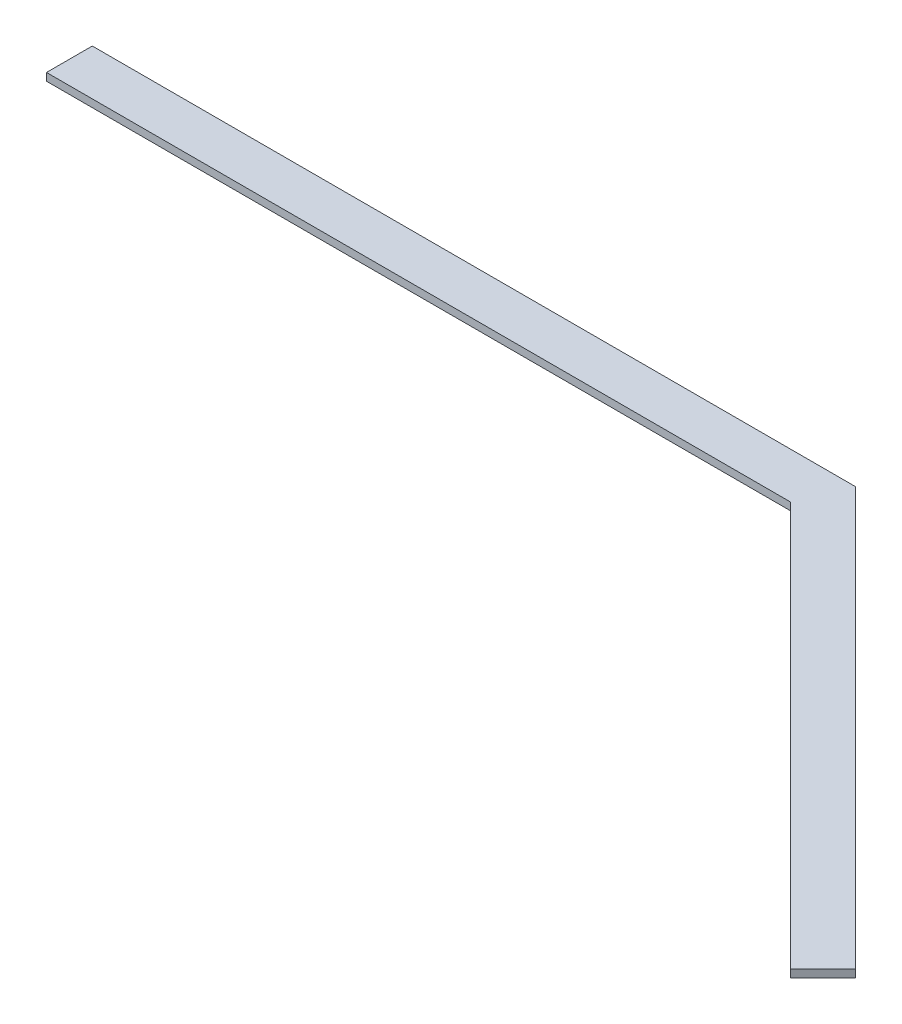
ISO-10303-21;
HEADER;
FILE_DESCRIPTION(('STEP AP214'),'2;1');
FILE_NAME('part.step','',(''),(''),'','','');
FILE_SCHEMA(('AUTOMOTIVE_DESIGN { 1 0 10303 214 1 1 1 1 }'));
ENDSEC;
DATA;
#1=APPLICATION_CONTEXT('core data for automotive mechanical design processes');
#2=APPLICATION_PROTOCOL_DEFINITION('international standard','automotive_design',2000,#1);
#3=PRODUCT_CONTEXT('',#1,'mechanical');
#4=PRODUCT('Part','Part','',(#3));
#5=PRODUCT_RELATED_PRODUCT_CATEGORY('part','',(#4));
#6=PRODUCT_DEFINITION_FORMATION('','',#4);
#7=PRODUCT_DEFINITION_CONTEXT('part definition',#1,'design');
#8=PRODUCT_DEFINITION('design','',#6,#7);
#9=PRODUCT_DEFINITION_SHAPE('','',#8);
#10=(LENGTH_UNIT() NAMED_UNIT(*) SI_UNIT(.MILLI.,.METRE.));
#11=(NAMED_UNIT(*) PLANE_ANGLE_UNIT() SI_UNIT($,.RADIAN.));
#12=(NAMED_UNIT(*) SI_UNIT($,.STERADIAN.) SOLID_ANGLE_UNIT());
#13=UNCERTAINTY_MEASURE_WITH_UNIT(LENGTH_MEASURE(1.E-05),#10,'distance_accuracy_value','');
#14=(GEOMETRIC_REPRESENTATION_CONTEXT(3) GLOBAL_UNCERTAINTY_ASSIGNED_CONTEXT((#13)) GLOBAL_UNIT_ASSIGNED_CONTEXT((#10,
#11,#12)) REPRESENTATION_CONTEXT('',''));
#15=CARTESIAN_POINT('',(0.,0.,0.));
#16=DIRECTION('',(0.,0.,1.));
#17=DIRECTION('',(1.,0.,0.));
#18=AXIS2_PLACEMENT_3D('',#15,#16,#17);
#19=CARTESIAN_POINT('',(-273.786796564403,5.,-273.786796564404));
#20=DIRECTION('',(-0.707106781186549,0.,0.707106781186546));
#21=DIRECTION('',(0.707106781186546,0.,0.707106781186549));
#22=AXIS2_PLACEMENT_3D('',#19,#20,#21);
#23=PLANE('',#22);
#24=DIRECTION('',(-0.707106781186546,0.,-0.707106781186549));
#25=VECTOR('',#24,1.);
#26=CARTESIAN_POINT('',(-273.786796564403,0.,-273.786796564404));
#27=LINE('',#26,#25);
#28=CARTESIAN_POINT('',(0.,0.,0.));
#29=VERTEX_POINT('',#28);
#30=CARTESIAN_POINT('',(-273.786796564403,0.,-273.786796564404));
#31=VERTEX_POINT('',#30);
#32=EDGE_CURVE('E121',#29,#31,#27,.T.);
#33=ORIENTED_EDGE('',*,*,#32,.T.);
#34=DIRECTION('',(0.,-1.,0.));
#35=VECTOR('',#34,1.);
#36=CARTESIAN_POINT('',(-273.786796564403,5.,-273.786796564404));
#37=LINE('',#36,#35);
#38=CARTESIAN_POINT('',(-273.786796564403,5.,-273.786796564404));
#39=VERTEX_POINT('',#38);
#40=EDGE_CURVE('E11',#39,#31,#37,.T.);
#41=ORIENTED_EDGE('',*,*,#40,.F.);
#42=DIRECTION('',(-0.707106781186546,0.,-0.707106781186549));
#43=VECTOR('',#42,1.);
#44=CARTESIAN_POINT('',(-273.786796564403,5.,-273.786796564404));
#45=LINE('',#44,#43);
#46=CARTESIAN_POINT('',(0.,5.,0.));
#47=VERTEX_POINT('',#46);
#48=EDGE_CURVE('E131',#47,#39,#45,.T.);
#49=ORIENTED_EDGE('',*,*,#48,.F.);
#50=DIRECTION('',(0.,-1.,0.));
#51=VECTOR('',#50,1.);
#52=CARTESIAN_POINT('',(0.,5.,0.));
#53=LINE('',#52,#51);
#54=EDGE_CURVE('E117',#47,#29,#53,.T.);
#55=ORIENTED_EDGE('',*,*,#54,.T.);
#56=EDGE_LOOP('',(#33,#41,#49,#55));
#57=FACE_BOUND('',#56,.T.);
#58=ADVANCED_FACE('F37',(#57),#23,.F.);
#59=CARTESIAN_POINT('',(-273.786796564403,5.,-273.786796564404));
#60=DIRECTION('',(0.,0.,1.));
#61=DIRECTION('',(1.,0.,0.));
#62=AXIS2_PLACEMENT_3D('',#59,#60,#61);
#63=PLANE('',#62);
#64=DIRECTION('',(-1.,0.,0.));
#65=VECTOR('',#64,1.);
#66=CARTESIAN_POINT('',(-273.786796564403,0.,-273.786796564404));
#67=LINE('',#66,#65);
#68=CARTESIAN_POINT('',(-773.786796564403,0.,-273.786796564404));
#69=VERTEX_POINT('',#68);
#70=EDGE_CURVE('E124',#31,#69,#67,.T.);
#71=ORIENTED_EDGE('',*,*,#70,.T.);
#72=DIRECTION('',(0.,-1.,0.));
#73=VECTOR('',#72,1.);
#74=CARTESIAN_POINT('',(-773.786796564403,5.,-273.786796564404));
#75=LINE('',#74,#73);
#76=CARTESIAN_POINT('',(-773.786796564403,5.,-273.786796564404));
#77=VERTEX_POINT('',#76);
#78=EDGE_CURVE('E45',#77,#69,#75,.T.);
#79=ORIENTED_EDGE('',*,*,#78,.F.);
#80=DIRECTION('',(-1.,0.,0.));
#81=VECTOR('',#80,1.);
#82=CARTESIAN_POINT('',(-273.786796564403,5.,-273.786796564404));
#83=LINE('',#82,#81);
#84=EDGE_CURVE('E90',#39,#77,#83,.T.);
#85=ORIENTED_EDGE('',*,*,#84,.F.);
#86=ORIENTED_EDGE('',*,*,#40,.T.);
#87=EDGE_LOOP('',(#71,#79,#85,#86));
#88=FACE_BOUND('',#87,.T.);
#89=ADVANCED_FACE('F155',(#88),#63,.F.);
#90=CARTESIAN_POINT('',(-773.786796564403,5.,-273.786796564404));
#91=DIRECTION('',(1.,0.,0.));
#92=DIRECTION('',(0.,0.,-1.));
#93=AXIS2_PLACEMENT_3D('',#90,#91,#92);
#94=PLANE('',#93);
#95=DIRECTION('',(0.,0.,1.));
#96=VECTOR('',#95,1.);
#97=CARTESIAN_POINT('',(-773.786796564403,0.,-273.786796564404));
#98=LINE('',#97,#96);
#99=CARTESIAN_POINT('',(-773.786796564402,0.,-243.786796564404));
#100=VERTEX_POINT('',#99);
#101=EDGE_CURVE('E126',#69,#100,#98,.T.);
#102=ORIENTED_EDGE('',*,*,#101,.T.);
#103=DIRECTION('',(0.,-1.,0.));
#104=VECTOR('',#103,1.);
#105=CARTESIAN_POINT('',(-773.786796564402,5.,-243.786796564404));
#106=LINE('',#105,#104);
#107=CARTESIAN_POINT('',(-773.786796564402,5.,-243.786796564404));
#108=VERTEX_POINT('',#107);
#109=EDGE_CURVE('E112',#108,#100,#106,.T.);
#110=ORIENTED_EDGE('',*,*,#109,.F.);
#111=DIRECTION('',(0.,0.,1.));
#112=VECTOR('',#111,1.);
#113=CARTESIAN_POINT('',(-773.786796564403,5.,-273.786796564404));
#114=LINE('',#113,#112);
#115=EDGE_CURVE('E103',#77,#108,#114,.T.);
#116=ORIENTED_EDGE('',*,*,#115,.F.);
#117=ORIENTED_EDGE('',*,*,#78,.T.);
#118=EDGE_LOOP('',(#102,#110,#116,#117));
#119=FACE_BOUND('',#118,.T.);
#120=ADVANCED_FACE('F137',(#119),#94,.F.);
#121=CARTESIAN_POINT('',(-773.786796564402,5.,-243.786796564404));
#122=DIRECTION('',(0.,0.,-1.));
#123=DIRECTION('',(-1.,0.,0.));
#124=AXIS2_PLACEMENT_3D('',#121,#122,#123);
#125=PLANE('',#124);
#126=DIRECTION('',(1.,0.,0.));
#127=VECTOR('',#126,1.);
#128=CARTESIAN_POINT('',(-773.786796564402,0.,-243.786796564404));
#129=LINE('',#128,#127);
#130=CARTESIAN_POINT('',(-286.213203435595,0.,-243.786796564404));
#131=VERTEX_POINT('',#130);
#132=EDGE_CURVE('E111',#100,#131,#129,.T.);
#133=ORIENTED_EDGE('',*,*,#132,.T.);
#134=DIRECTION('',(0.,-1.,0.));
#135=VECTOR('',#134,1.);
#136=CARTESIAN_POINT('',(-286.213203435595,5.,-243.786796564404));
#137=LINE('',#136,#135);
#138=CARTESIAN_POINT('',(-286.213203435595,5.,-243.786796564404));
#139=VERTEX_POINT('',#138);
#140=EDGE_CURVE('E108',#139,#131,#137,.T.);
#141=ORIENTED_EDGE('',*,*,#140,.F.);
#142=DIRECTION('',(1.,0.,0.));
#143=VECTOR('',#142,1.);
#144=CARTESIAN_POINT('',(-773.786796564402,5.,-243.786796564404));
#145=LINE('',#144,#143);
#146=EDGE_CURVE('E97',#108,#139,#145,.T.);
#147=ORIENTED_EDGE('',*,*,#146,.F.);
#148=ORIENTED_EDGE('',*,*,#109,.T.);
#149=EDGE_LOOP('',(#133,#141,#147,#148));
#150=FACE_BOUND('',#149,.T.);
#151=ADVANCED_FACE('F109',(#150),#125,.F.);
#152=CARTESIAN_POINT('',(-286.213203435595,5.,-243.786796564404));
#153=DIRECTION('',(0.707106781186549,0.,-0.707106781186546));
#154=DIRECTION('',(-0.707106781186546,0.,-0.707106781186549));
#155=AXIS2_PLACEMENT_3D('',#152,#153,#154);
#156=PLANE('',#155);
#157=DIRECTION('',(0.707106781186546,0.,0.707106781186549));
#158=VECTOR('',#157,1.);
#159=CARTESIAN_POINT('',(-286.213203435595,0.,-243.786796564404));
#160=LINE('',#159,#158);
#161=CARTESIAN_POINT('',(-21.2132034355963,0.,21.2132034355964));
#162=VERTEX_POINT('',#161);
#163=EDGE_CURVE('E76',#131,#162,#160,.T.);
#164=ORIENTED_EDGE('',*,*,#163,.T.);
#165=DIRECTION('',(0.,-1.,0.));
#166=VECTOR('',#165,1.);
#167=CARTESIAN_POINT('',(-21.2132034355963,5.,21.2132034355964));
#168=LINE('',#167,#166);
#169=CARTESIAN_POINT('',(-21.2132034355963,5.,21.2132034355964));
#170=VERTEX_POINT('',#169);
#171=EDGE_CURVE('E113',#170,#162,#168,.T.);
#172=ORIENTED_EDGE('',*,*,#171,.F.);
#173=DIRECTION('',(0.707106781186546,0.,0.707106781186549));
#174=VECTOR('',#173,1.);
#175=CARTESIAN_POINT('',(-286.213203435595,5.,-243.786796564404));
#176=LINE('',#175,#174);
#177=EDGE_CURVE('E101',#139,#170,#176,.T.);
#178=ORIENTED_EDGE('',*,*,#177,.F.);
#179=ORIENTED_EDGE('',*,*,#140,.T.);
#180=EDGE_LOOP('',(#164,#172,#178,#179));
#181=FACE_BOUND('',#180,.T.);
#182=ADVANCED_FACE('F115',(#181),#156,.F.);
#183=CARTESIAN_POINT('',(-21.2132034355963,5.,21.2132034355964));
#184=DIRECTION('',(-0.707106781186549,0.,-0.707106781186546));
#185=DIRECTION('',(-0.707106781186546,0.,0.707106781186549));
#186=AXIS2_PLACEMENT_3D('',#183,#184,#185);
#187=PLANE('',#186);
#188=DIRECTION('',(0.707106781186546,0.,-0.707106781186549));
#189=VECTOR('',#188,1.);
#190=CARTESIAN_POINT('',(-21.2132034355963,0.,21.2132034355964));
#191=LINE('',#190,#189);
#192=EDGE_CURVE('E82',#162,#29,#191,.T.);
#193=ORIENTED_EDGE('',*,*,#192,.T.);
#194=ORIENTED_EDGE('',*,*,#54,.F.);
#195=DIRECTION('',(0.707106781186546,0.,-0.707106781186549));
#196=VECTOR('',#195,1.);
#197=CARTESIAN_POINT('',(-21.2132034355963,5.,21.2132034355964));
#198=LINE('',#197,#196);
#199=EDGE_CURVE('E53',#170,#47,#198,.T.);
#200=ORIENTED_EDGE('',*,*,#199,.F.);
#201=ORIENTED_EDGE('',*,*,#171,.T.);
#202=EDGE_LOOP('',(#193,#194,#200,#201));
#203=FACE_BOUND('',#202,.T.);
#204=ADVANCED_FACE('F144',(#203),#187,.F.);
#205=CARTESIAN_POINT('',(0.,5.,0.));
#206=DIRECTION('',(0.,1.,0.));
#207=DIRECTION('',(0.,0.,1.));
#208=AXIS2_PLACEMENT_3D('',#205,#206,#207);
#209=PLANE('',#208);
#210=ORIENTED_EDGE('',*,*,#48,.T.);
#211=ORIENTED_EDGE('',*,*,#84,.T.);
#212=ORIENTED_EDGE('',*,*,#115,.T.);
#213=ORIENTED_EDGE('',*,*,#146,.T.);
#214=ORIENTED_EDGE('',*,*,#177,.T.);
#215=ORIENTED_EDGE('',*,*,#199,.T.);
#216=EDGE_LOOP('',(#210,#211,#212,#213,#214,#215));
#217=FACE_BOUND('',#216,.T.);
#218=ADVANCED_FACE('F99',(#217),#209,.T.);
#219=CARTESIAN_POINT('',(0.,0.,0.));
#220=DIRECTION('',(0.,1.,0.));
#221=DIRECTION('',(0.,0.,1.));
#222=AXIS2_PLACEMENT_3D('',#219,#220,#221);
#223=PLANE('',#222);
#224=ORIENTED_EDGE('',*,*,#32,.F.);
#225=ORIENTED_EDGE('',*,*,#192,.F.);
#226=ORIENTED_EDGE('',*,*,#163,.F.);
#227=ORIENTED_EDGE('',*,*,#132,.F.);
#228=ORIENTED_EDGE('',*,*,#101,.F.);
#229=ORIENTED_EDGE('',*,*,#70,.F.);
#230=EDGE_LOOP('',(#224,#225,#226,#227,#228,#229));
#231=FACE_BOUND('',#230,.T.);
#232=ADVANCED_FACE('F140',(#231),#223,.F.);
#233=CLOSED_SHELL('',(#58,#89,#120,#151,#182,#204,#218,#232));
#234=MANIFOLD_SOLID_BREP('B2',#233);
#235=ADVANCED_BREP_SHAPE_REPRESENTATION('',(#18,#234),#14);
#236=SHAPE_DEFINITION_REPRESENTATION(#9,#235);
ENDSEC;
END-ISO-10303-21;
